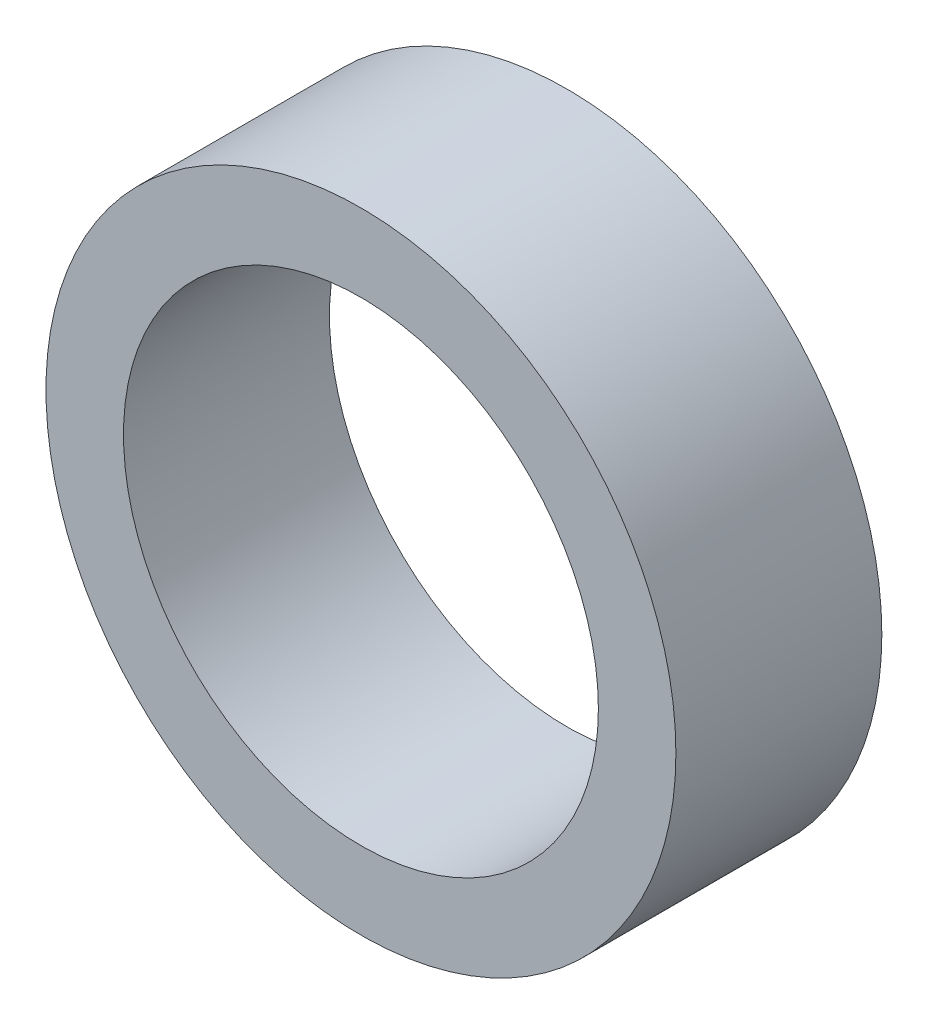
ISO-10303-21;
HEADER;
FILE_DESCRIPTION(('STEP AP214'),'2;1');
FILE_NAME('part.step','',(''),(''),'','','');
FILE_SCHEMA(('AUTOMOTIVE_DESIGN { 1 0 10303 214 1 1 1 1 }'));
ENDSEC;
DATA;
#1=APPLICATION_CONTEXT('core data for automotive mechanical design processes');
#2=APPLICATION_PROTOCOL_DEFINITION('international standard','automotive_design',2000,#1);
#3=PRODUCT_CONTEXT('',#1,'mechanical');
#4=PRODUCT('Part','Part','',(#3));
#5=PRODUCT_RELATED_PRODUCT_CATEGORY('part','',(#4));
#6=PRODUCT_DEFINITION_FORMATION('','',#4);
#7=PRODUCT_DEFINITION_CONTEXT('part definition',#1,'design');
#8=PRODUCT_DEFINITION('design','',#6,#7);
#9=PRODUCT_DEFINITION_SHAPE('','',#8);
#10=(LENGTH_UNIT() NAMED_UNIT(*) SI_UNIT(.MILLI.,.METRE.));
#11=(NAMED_UNIT(*) PLANE_ANGLE_UNIT() SI_UNIT($,.RADIAN.));
#12=(NAMED_UNIT(*) SI_UNIT($,.STERADIAN.) SOLID_ANGLE_UNIT());
#13=UNCERTAINTY_MEASURE_WITH_UNIT(LENGTH_MEASURE(1.E-05),#10,'distance_accuracy_value','');
#14=(GEOMETRIC_REPRESENTATION_CONTEXT(3) GLOBAL_UNCERTAINTY_ASSIGNED_CONTEXT((#13)) GLOBAL_UNIT_ASSIGNED_CONTEXT((#10,
#11,#12)) REPRESENTATION_CONTEXT('',''));
#15=CARTESIAN_POINT('',(0.,0.,0.));
#16=DIRECTION('',(0.,0.,1.));
#17=DIRECTION('',(1.,0.,0.));
#18=AXIS2_PLACEMENT_3D('',#15,#16,#17);
#19=CARTESIAN_POINT('',(0.,6.50000000000001,-18.75));
#20=DIRECTION('',(0.,0.,1.));
#21=DIRECTION('',(1.,0.,0.));
#22=AXIS2_PLACEMENT_3D('',#19,#20,#21);
#23=PLANE('',#22);
#24=CARTESIAN_POINT('',(0.,0.,-18.75));
#25=DIRECTION('',(0.,0.,1.));
#26=DIRECTION('',(1.,0.,0.));
#27=AXIS2_PLACEMENT_3D('',#24,#25,#26);
#28=CIRCLE('',#27,6.5);
#29=CARTESIAN_POINT('',(6.50000000000001,0.,-18.75));
#30=VERTEX_POINT('',#29);
#31=EDGE_CURVE('E47',#30,#30,#28,.T.);
#32=ORIENTED_EDGE('',*,*,#31,.F.);
#33=EDGE_LOOP('',(#32));
#34=FACE_BOUND('',#33,.T.);
#35=CARTESIAN_POINT('',(0.,0.,-18.75));
#36=DIRECTION('',(0.,0.,1.));
#37=DIRECTION('',(1.,0.,0.));
#38=AXIS2_PLACEMENT_3D('',#35,#36,#37);
#39=CIRCLE('',#38,4.9);
#40=CARTESIAN_POINT('',(4.9,0.,-18.75));
#41=VERTEX_POINT('',#40);
#42=EDGE_CURVE('E10',#41,#41,#39,.T.);
#43=ORIENTED_EDGE('',*,*,#42,.T.);
#44=EDGE_LOOP('',(#43));
#45=FACE_BOUND('',#44,.T.);
#46=ADVANCED_FACE('F33',(#34,#45),#23,.F.);
#47=CARTESIAN_POINT('',(0.,0.,1000.));
#48=DIRECTION('',(0.,0.,1.));
#49=DIRECTION('',(1.,0.,0.));
#50=AXIS2_PLACEMENT_3D('',#47,#48,#49);
#51=CYLINDRICAL_SURFACE('',#50,4.9);
#52=ORIENTED_EDGE('',*,*,#42,.F.);
#53=EDGE_LOOP('',(#52));
#54=FACE_BOUND('',#53,.T.);
#55=CARTESIAN_POINT('',(0.,0.,-14.5));
#56=DIRECTION('',(0.,0.,1.));
#57=DIRECTION('',(1.,0.,0.));
#58=AXIS2_PLACEMENT_3D('',#55,#56,#57);
#59=CIRCLE('',#58,4.9);
#60=CARTESIAN_POINT('',(4.9,0.,-14.5));
#61=VERTEX_POINT('',#60);
#62=EDGE_CURVE('E39',#61,#61,#59,.T.);
#63=ORIENTED_EDGE('',*,*,#62,.T.);
#64=EDGE_LOOP('',(#63));
#65=FACE_BOUND('',#64,.T.);
#66=ADVANCED_FACE('F56',(#54,#65),#51,.F.);
#67=CARTESIAN_POINT('',(0.,6.50000000000001,-14.5));
#68=DIRECTION('',(0.,0.,-1.));
#69=DIRECTION('',(-1.,0.,0.));
#70=AXIS2_PLACEMENT_3D('',#67,#68,#69);
#71=PLANE('',#70);
#72=ORIENTED_EDGE('',*,*,#62,.F.);
#73=EDGE_LOOP('',(#72));
#74=FACE_BOUND('',#73,.T.);
#75=CARTESIAN_POINT('',(0.,0.,-14.5));
#76=DIRECTION('',(0.,0.,1.));
#77=DIRECTION('',(1.,0.,0.));
#78=AXIS2_PLACEMENT_3D('',#75,#76,#77);
#79=CIRCLE('',#78,6.5);
#80=CARTESIAN_POINT('',(6.5,0.,-14.5));
#81=VERTEX_POINT('',#80);
#82=EDGE_CURVE('E43',#81,#81,#79,.T.);
#83=ORIENTED_EDGE('',*,*,#82,.T.);
#84=EDGE_LOOP('',(#83));
#85=FACE_BOUND('',#84,.T.);
#86=ADVANCED_FACE('F60',(#74,#85),#71,.F.);
#87=CARTESIAN_POINT('',(0.,0.,1000.));
#88=DIRECTION('',(0.,0.,1.));
#89=DIRECTION('',(1.,0.,0.));
#90=AXIS2_PLACEMENT_3D('',#87,#88,#89);
#91=CYLINDRICAL_SURFACE('',#90,6.5);
#92=ORIENTED_EDGE('',*,*,#82,.F.);
#93=EDGE_LOOP('',(#92));
#94=FACE_BOUND('',#93,.T.);
#95=ORIENTED_EDGE('',*,*,#31,.T.);
#96=EDGE_LOOP('',(#95));
#97=FACE_BOUND('',#96,.T.);
#98=ADVANCED_FACE('F53',(#94,#97),#91,.T.);
#99=CLOSED_SHELL('',(#46,#66,#86,#98));
#100=MANIFOLD_SOLID_BREP('B2',#99);
#101=ADVANCED_BREP_SHAPE_REPRESENTATION('',(#18,#100),#14);
#102=SHAPE_DEFINITION_REPRESENTATION(#9,#101);
ENDSEC;
END-ISO-10303-21;
